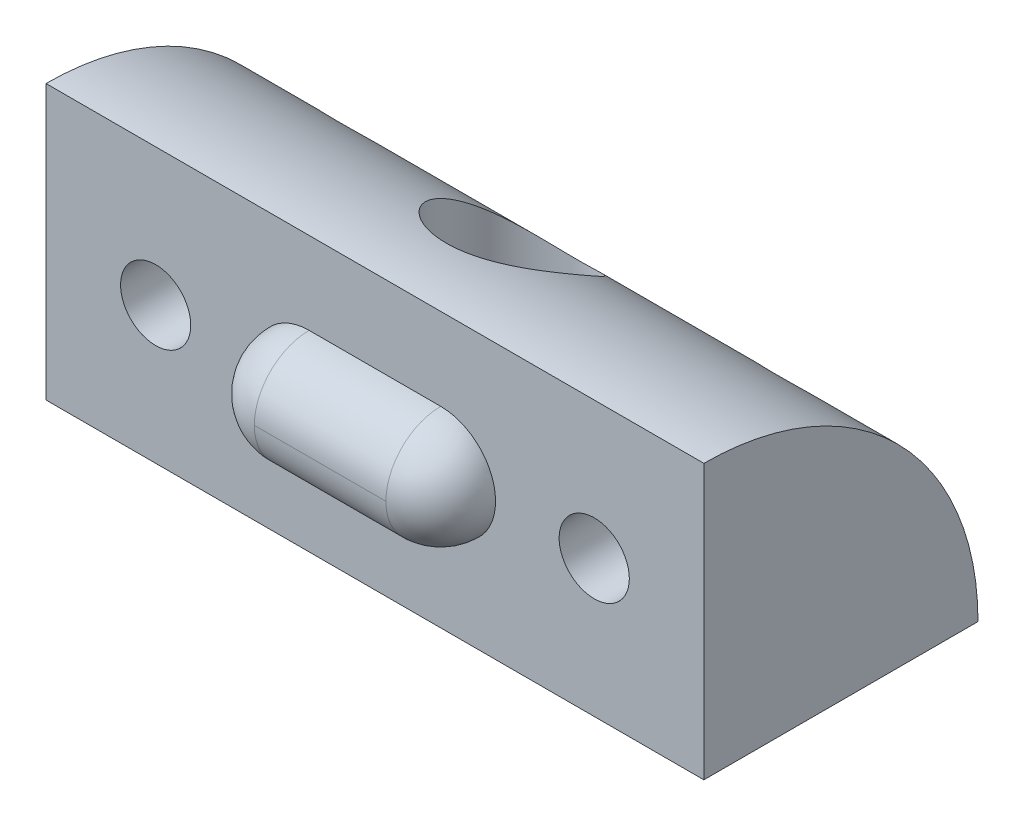
ISO-10303-21;
HEADER;
FILE_DESCRIPTION(('STEP AP214'),'2;1');
FILE_NAME('part.step','',(''),(''),'','','');
FILE_SCHEMA(('AUTOMOTIVE_DESIGN { 1 0 10303 214 1 1 1 1 }'));
ENDSEC;
DATA;
#1=APPLICATION_CONTEXT('core data for automotive mechanical design processes');
#2=APPLICATION_PROTOCOL_DEFINITION('international standard','automotive_design',2000,#1);
#3=PRODUCT_CONTEXT('',#1,'mechanical');
#4=PRODUCT('Part','Part','',(#3));
#5=PRODUCT_RELATED_PRODUCT_CATEGORY('part','',(#4));
#6=PRODUCT_DEFINITION_FORMATION('','',#4);
#7=PRODUCT_DEFINITION_CONTEXT('part definition',#1,'design');
#8=PRODUCT_DEFINITION('design','',#6,#7);
#9=PRODUCT_DEFINITION_SHAPE('','',#8);
#10=(LENGTH_UNIT() NAMED_UNIT(*) SI_UNIT(.MILLI.,.METRE.));
#11=(NAMED_UNIT(*) PLANE_ANGLE_UNIT() SI_UNIT($,.RADIAN.));
#12=(NAMED_UNIT(*) SI_UNIT($,.STERADIAN.) SOLID_ANGLE_UNIT());
#13=UNCERTAINTY_MEASURE_WITH_UNIT(LENGTH_MEASURE(1.E-05),#10,'distance_accuracy_value','');
#14=(GEOMETRIC_REPRESENTATION_CONTEXT(3) GLOBAL_UNCERTAINTY_ASSIGNED_CONTEXT((#13)) GLOBAL_UNIT_ASSIGNED_CONTEXT((#10,
#11,#12)) REPRESENTATION_CONTEXT('',''));
#15=CARTESIAN_POINT('',(0.,0.,0.));
#16=DIRECTION('',(0.,0.,1.));
#17=DIRECTION('',(1.,0.,0.));
#18=AXIS2_PLACEMENT_3D('',#15,#16,#17);
#19=CARTESIAN_POINT('',(70.,0.,0.));
#20=DIRECTION('',(0.,0.,-1.));
#21=DIRECTION('',(-1.,0.,0.));
#22=AXIS2_PLACEMENT_3D('',#19,#20,#21);
#23=PLANE('',#22);
#24=DIRECTION('',(0.,1.,0.));
#25=VECTOR('',#24,1.);
#26=CARTESIAN_POINT('',(40.,0.,0.));
#27=LINE('',#26,#25);
#28=CARTESIAN_POINT('',(40.,0.,0.));
#29=VERTEX_POINT('',#28);
#30=CARTESIAN_POINT('',(40.,12.5,0.));
#31=VERTEX_POINT('',#30);
#32=EDGE_CURVE('E106',#29,#31,#27,.T.);
#33=ORIENTED_EDGE('',*,*,#32,.F.);
#34=DIRECTION('',(-1.,0.,0.));
#35=VECTOR('',#34,1.);
#36=CARTESIAN_POINT('',(70.,0.,0.));
#37=LINE('',#36,#35);
#38=CARTESIAN_POINT('',(70.,0.,0.));
#39=VERTEX_POINT('',#38);
#40=EDGE_CURVE('E179',#39,#29,#37,.T.);
#41=ORIENTED_EDGE('',*,*,#40,.F.);
#42=DIRECTION('',(0.,-1.,0.));
#43=VECTOR('',#42,1.);
#44=CARTESIAN_POINT('',(70.,0.,0.));
#45=LINE('',#44,#43);
#46=CARTESIAN_POINT('',(70.,12.5,0.));
#47=VERTEX_POINT('',#46);
#48=EDGE_CURVE('E182',#47,#39,#45,.T.);
#49=ORIENTED_EDGE('',*,*,#48,.F.);
#50=DIRECTION('',(-1.,0.,0.));
#51=VECTOR('',#50,1.);
#52=CARTESIAN_POINT('',(70.,12.5,0.));
#53=LINE('',#52,#51);
#54=EDGE_CURVE('E45',#47,#31,#53,.T.);
#55=ORIENTED_EDGE('',*,*,#54,.T.);
#56=EDGE_LOOP('',(#33,#41,#49,#55));
#57=FACE_BOUND('',#56,.T.);
#58=CARTESIAN_POINT('',(45.,6.25,0.));
#59=DIRECTION('',(0.,0.,1.));
#60=DIRECTION('',(1.,0.,0.));
#61=AXIS2_PLACEMENT_3D('',#58,#59,#60);
#62=CIRCLE('',#61,1.6);
#63=CARTESIAN_POINT('',(46.6,6.25,0.));
#64=VERTEX_POINT('',#63);
#65=EDGE_CURVE('E189',#64,#64,#62,.T.);
#66=ORIENTED_EDGE('',*,*,#65,.F.);
#67=EDGE_LOOP('',(#66));
#68=FACE_BOUND('',#67,.T.);
#69=CARTESIAN_POINT('',(65.,6.25,0.));
#70=DIRECTION('',(0.,0.,1.));
#71=DIRECTION('',(1.,0.,0.));
#72=AXIS2_PLACEMENT_3D('',#69,#70,#71);
#73=CIRCLE('',#72,1.60000000000001);
#74=CARTESIAN_POINT('',(66.6,6.25,0.));
#75=VERTEX_POINT('',#74);
#76=EDGE_CURVE('E190',#75,#75,#73,.T.);
#77=ORIENTED_EDGE('',*,*,#76,.F.);
#78=EDGE_LOOP('',(#77));
#79=FACE_BOUND('',#78,.T.);
#80=CARTESIAN_POINT('',(58.,6.25,0.));
#81=DIRECTION('',(0.,0.,1.));
#82=DIRECTION('',(1.,0.,0.));
#83=AXIS2_PLACEMENT_3D('',#80,#81,#82);
#84=CIRCLE('',#83,2.5);
#85=CARTESIAN_POINT('',(58.,3.75,0.));
#86=VERTEX_POINT('',#85);
#87=CARTESIAN_POINT('',(58.,8.75,0.));
#88=VERTEX_POINT('',#87);
#89=EDGE_CURVE('E74',#86,#88,#84,.T.);
#90=ORIENTED_EDGE('',*,*,#89,.F.);
#91=DIRECTION('',(1.,0.,0.));
#92=VECTOR('',#91,1.);
#93=CARTESIAN_POINT('',(58.,3.75,0.));
#94=LINE('',#93,#92);
#95=CARTESIAN_POINT('',(52.,3.75,0.));
#96=VERTEX_POINT('',#95);
#97=EDGE_CURVE('E100',#96,#86,#94,.T.);
#98=ORIENTED_EDGE('',*,*,#97,.F.);
#99=CARTESIAN_POINT('',(52.,6.25,0.));
#100=DIRECTION('',(0.,0.,1.));
#101=DIRECTION('',(1.,0.,0.));
#102=AXIS2_PLACEMENT_3D('',#99,#100,#101);
#103=CIRCLE('',#102,2.5);
#104=CARTESIAN_POINT('',(52.,8.75,0.));
#105=VERTEX_POINT('',#104);
#106=EDGE_CURVE('E104',#105,#96,#103,.T.);
#107=ORIENTED_EDGE('',*,*,#106,.F.);
#108=DIRECTION('',(-1.,0.,0.));
#109=VECTOR('',#108,1.);
#110=CARTESIAN_POINT('',(58.,8.75,0.));
#111=LINE('',#110,#109);
#112=EDGE_CURVE('E54',#88,#105,#111,.T.);
#113=ORIENTED_EDGE('',*,*,#112,.F.);
#114=EDGE_LOOP('',(#90,#98,#107,#113));
#115=FACE_BOUND('',#114,.T.);
#116=ADVANCED_FACE('F35',(#57,#68,#79,#115),#23,.F.);
#117=CARTESIAN_POINT('',(70.,0.,0.));
#118=DIRECTION('',(0.,1.,0.));
#119=DIRECTION('',(0.,0.,1.));
#120=AXIS2_PLACEMENT_3D('',#117,#118,#119);
#121=PLANE('',#120);
#122=CARTESIAN_POINT('',(55.,0.,-6.25));
#123=DIRECTION('',(0.,-1.,0.));
#124=DIRECTION('',(0.,0.,-1.));
#125=AXIS2_PLACEMENT_3D('',#122,#123,#124);
#126=CIRCLE('',#125,3.);
#127=CARTESIAN_POINT('',(55.,0.,-9.25));
#128=VERTEX_POINT('',#127);
#129=EDGE_CURVE('E115',#128,#128,#126,.T.);
#130=ORIENTED_EDGE('',*,*,#129,.F.);
#131=EDGE_LOOP('',(#130));
#132=FACE_BOUND('',#131,.T.);
#133=DIRECTION('',(0.,0.,1.));
#134=VECTOR('',#133,1.);
#135=CARTESIAN_POINT('',(40.,0.,0.));
#136=LINE('',#135,#134);
#137=CARTESIAN_POINT('',(40.,0.,-12.5));
#138=VERTEX_POINT('',#137);
#139=EDGE_CURVE('E108',#138,#29,#136,.T.);
#140=ORIENTED_EDGE('',*,*,#139,.F.);
#141=DIRECTION('',(-1.,0.,0.));
#142=VECTOR('',#141,1.);
#143=CARTESIAN_POINT('',(70.,0.,-12.5));
#144=LINE('',#143,#142);
#145=CARTESIAN_POINT('',(70.,0.,-12.5));
#146=VERTEX_POINT('',#145);
#147=EDGE_CURVE('E11',#146,#138,#144,.T.);
#148=ORIENTED_EDGE('',*,*,#147,.F.);
#149=DIRECTION('',(0.,0.,-1.));
#150=VECTOR('',#149,1.);
#151=CARTESIAN_POINT('',(70.,0.,0.));
#152=LINE('',#151,#150);
#153=EDGE_CURVE('E186',#39,#146,#152,.T.);
#154=ORIENTED_EDGE('',*,*,#153,.F.);
#155=ORIENTED_EDGE('',*,*,#40,.T.);
#156=EDGE_LOOP('',(#140,#148,#154,#155));
#157=FACE_BOUND('',#156,.T.);
#158=ADVANCED_FACE('F146',(#132,#157),#121,.F.);
#159=CARTESIAN_POINT('',(70.,0.,0.));
#160=DIRECTION('',(-1.,0.,0.));
#161=DIRECTION('',(0.,0.,1.));
#162=AXIS2_PLACEMENT_3D('',#159,#160,#161);
#163=CYLINDRICAL_SURFACE('',#162,12.5);
#164=CARTESIAN_POINT('',(68.,6.25,-10.8253175473055));
#165=CARTESIAN_POINT('',(67.9999973266204,6.08166476944066,-10.9225007656544));
#166=CARTESIAN_POINT('',(67.9858168927422,5.91085991304591,-11.0158425192816));
#167=CARTESIAN_POINT('',(67.9268116727942,5.56893258641195,-11.1925875034078));
#168=CARTESIAN_POINT('',(67.881947018588,5.39780999216046,-11.275977637969));
#169=CARTESIAN_POINT('',(67.7906657534425,5.14533384977919,-11.3922906288415));
#170=CARTESIAN_POINT('',(67.7560999906545,5.06162964623966,-11.4296993282792));
#171=CARTESIAN_POINT('',(67.6789274548428,4.89662357664193,-11.5013536954113));
#172=CARTESIAN_POINT('',(67.6363242262492,4.81532066984877,-11.5356007474785));
#173=CARTESIAN_POINT('',(67.5431947029471,4.65605197120116,-11.6008013146132));
#174=CARTESIAN_POINT('',(67.4926718876983,4.57808473288429,-11.631756266083));
#175=CARTESIAN_POINT('',(67.3839283600971,4.42637953936193,-11.6903281855886));
#176=CARTESIAN_POINT('',(67.3257084975279,4.35264111856559,-11.7179455214666));
#177=CARTESIAN_POINT('',(67.2079134943238,4.21717392841966,-11.7673333214823));
#178=CARTESIAN_POINT('',(67.1490093176383,4.15497255080365,-11.7894107472818));
#179=CARTESIAN_POINT('',(67.0255687947048,4.03539897506827,-11.8308732109975));
#180=CARTESIAN_POINT('',(66.9610304639027,3.97802849265868,-11.8502572939389));
#181=CARTESIAN_POINT('',(66.8268251272258,3.86878442444124,-11.8863710900934));
#182=CARTESIAN_POINT('',(66.7571612195077,3.81690756352832,-11.9031023877966));
#183=CARTESIAN_POINT('',(66.6131988031283,3.71915515562737,-11.9340064698822));
#184=CARTESIAN_POINT('',(66.5388986485812,3.67328175799915,-11.9481783386242));
#185=CARTESIAN_POINT('',(66.3191422967688,3.55059940795259,-11.9854195102371));
#186=CARTESIAN_POINT('',(66.168457348775,3.48196655043035,-12.005384128521));
#187=CARTESIAN_POINT('',(65.8571803312922,3.37030895397797,-12.037209750765));
#188=CARTESIAN_POINT('',(65.6965896190894,3.32728071527113,-12.049071862252));
#189=CARTESIAN_POINT('',(65.3728592706779,3.26879794782722,-12.0650681051611));
#190=CARTESIAN_POINT('',(65.209807141428,3.25289443382583,-12.0693281271344));
#191=CARTESIAN_POINT('',(64.8832637909658,3.24782745948786,-12.0706928940414));
#192=CARTESIAN_POINT('',(64.7197725807565,3.25866333522313,-12.0677978166333));
#193=CARTESIAN_POINT('',(64.3974017447757,3.30664046417044,-12.0547390748307));
#194=CARTESIAN_POINT('',(64.2385119020278,3.34371789545777,-12.0445930448499));
#195=CARTESIAN_POINT('',(63.9294357800333,3.4428256809326,-12.0166377285413));
#196=CARTESIAN_POINT('',(63.7792491866696,3.50485513391074,-11.9988287189811));
#197=CARTESIAN_POINT('',(63.4915603256694,3.65178269143177,-11.9549295448695));
#198=CARTESIAN_POINT('',(63.3540766342677,3.7367135971344,-11.9288274927732));
#199=CARTESIAN_POINT('',(63.0957322253052,3.92633045242945,-11.8677637747331));
#200=CARTESIAN_POINT('',(62.974871102794,4.03101592062407,-11.8328023246762));
#201=CARTESIAN_POINT('',(62.7514039412975,4.25765669875745,-11.7531661147979));
#202=CARTESIAN_POINT('',(62.6490237740029,4.37979673496618,-11.7083842949025));
#203=CARTESIAN_POINT('',(62.4662483794489,4.63603422895777,-11.609308388074));
#204=CARTESIAN_POINT('',(62.385855746113,4.77013309508083,-11.5550131800615));
#205=CARTESIAN_POINT('',(62.2450622842901,5.05162107648432,-11.4348363589837));
#206=CARTESIAN_POINT('',(62.1856412413285,5.19933170379415,-11.3685643360296));
#207=CARTESIAN_POINT('',(62.0914867810008,5.49824316442016,-11.2270523177831));
#208=CARTESIAN_POINT('',(62.0567625178204,5.64944527048075,-11.1518090092195));
#209=CARTESIAN_POINT('',(62.0088651896586,5.96544000405546,-10.9862732546593));
#210=CARTESIAN_POINT('',(61.9980011348576,6.13018650712781,-10.8952318539103));
#211=CARTESIAN_POINT('',(62.0026043541375,6.45505160150145,-10.7059667655623));
#212=CARTESIAN_POINT('',(62.0180808462999,6.61516855271068,-10.6077405751033));
#213=CARTESIAN_POINT('',(62.0770951709249,6.94951046649875,-10.3922627946695));
#214=CARTESIAN_POINT('',(62.124225910264,7.12261380260256,-10.2742615189599));
#215=CARTESIAN_POINT('',(62.2473674279646,7.45609699092058,-10.0348790749703));
#216=CARTESIAN_POINT('',(62.3234183554811,7.6164587785014,-9.91349342633819));
#217=CARTESIAN_POINT('',(62.4635696467191,7.85514694388913,-9.72413619066091));
#218=CARTESIAN_POINT('',(62.5184688679155,7.93880482636895,-9.65590725647512));
#219=CARTESIAN_POINT('',(62.6368105594293,8.10078308376453,-9.52042241485925));
#220=CARTESIAN_POINT('',(62.7002551559596,8.1791021229711,-9.4531667542207));
#221=CARTESIAN_POINT('',(62.8355620395315,8.3297720201676,-9.32067341060217));
#222=CARTESIAN_POINT('',(62.9074154066027,8.40212906617064,-9.25543368038264));
#223=CARTESIAN_POINT('',(63.059611714218,8.54029479483283,-9.12809899734072));
#224=CARTESIAN_POINT('',(63.1399500868163,8.60610696427867,-9.06600237877656));
#225=CARTESIAN_POINT('',(63.33470786413,8.74909253749897,-8.92837734866243));
#226=CARTESIAN_POINT('',(63.4521227842016,8.82375452227944,-8.85440529442961));
#227=CARTESIAN_POINT('',(63.701493243671,8.95811053686501,-8.7184509054412));
#228=CARTESIAN_POINT('',(63.8334215126426,9.01783197088064,-8.65644666757568));
#229=CARTESIAN_POINT('',(64.0826981089934,9.10874245966485,-8.56062351542304));
#230=CARTESIAN_POINT('',(64.1975938424691,9.14325982541012,-8.52364001933629));
#231=CARTESIAN_POINT('',(64.4341878646062,9.19865585196656,-8.46382975339931));
#232=CARTESIAN_POINT('',(64.55587939688,9.21954780604178,-8.44098918648693));
#233=CARTESIAN_POINT('',(64.8036912281418,9.24617516166478,-8.41181697827873));
#234=CARTESIAN_POINT('',(64.9298339062167,9.2518178966057,-8.40558627505534));
#235=CARTESIAN_POINT('',(65.1814607388624,9.24714980642375,-8.41072110563979));
#236=CARTESIAN_POINT('',(65.3069448653725,9.23683830694501,-8.42208738323935));
#237=CARTESIAN_POINT('',(65.5419649790369,9.20281405155784,-8.45924058898394));
#238=CARTESIAN_POINT('',(65.6519201599882,9.18039028173262,-8.48363829340057));
#239=CARTESIAN_POINT('',(65.8657211266792,9.12450118528426,-8.54372052651832));
#240=CARTESIAN_POINT('',(65.9695637740596,9.09103024398218,-8.57941079423556));
#241=CARTESIAN_POINT('',(66.2182770621743,8.99609986041725,-8.67910584844492));
#242=CARTESIAN_POINT('',(66.3588167640645,8.92892471172138,-8.74846845351311));
#243=CARTESIAN_POINT('',(66.6228761374935,8.77775445304617,-8.90014376461336));
#244=CARTESIAN_POINT('',(66.7463518723194,8.69371724042968,-8.98248877368765));
#245=CARTESIAN_POINT('',(67.0166680601018,8.47986022113171,-9.18534270164034));
#246=CARTESIAN_POINT('',(67.1565308062729,8.34431719562657,-9.30911258014853));
#247=CARTESIAN_POINT('',(67.4058182245213,8.05247268365261,-9.5626992565583));
#248=CARTESIAN_POINT('',(67.5152052558842,7.89614587578619,-9.69252330310692));
#249=CARTESIAN_POINT('',(67.7041632568473,7.56327997146987,-9.95451628347097));
#250=CARTESIAN_POINT('',(67.7832279218419,7.38645693018936,-10.0866894327606));
#251=CARTESIAN_POINT('',(67.9064083218888,7.01828461757614,-10.3462110581482));
#252=CARTESIAN_POINT('',(67.9506324731979,6.82698245523553,-10.4735733174591));
#253=CARTESIAN_POINT('',(67.9837452979679,6.56818467307366,-10.6355276503307));
#254=CARTESIAN_POINT('',(67.9898058286325,6.50515556812303,-10.6741949915242));
#255=CARTESIAN_POINT('',(67.9979345615712,6.37820460532468,-10.7505344265753));
#256=CARTESIAN_POINT('',(68.0000010208865,6.31428236997697,-10.7882060788583));
#257=CARTESIAN_POINT('',(68.,6.25,-10.8253175473055));
#258=B_SPLINE_CURVE_WITH_KNOTS('',3,(#164,#165,#166,#167,#168,#169,#170,#171,#172,#173,#174,
#175,#176,#177,#178,#179,#180,#181,#182,#183,#184,#185,#186,#187,#188,#189,#190,#191,#192,#193,
#194,#195,#196,#197,#198,#199,#200,#201,#202,#203,#204,#205,#206,#207,#208,#209,#210,#211,#212,
#213,#214,#215,#216,#217,#218,#219,#220,#221,#222,#223,#224,#225,#226,#227,#228,#229,#230,#231,
#232,#233,#234,#235,#236,#237,#238,#239,#240,#241,#242,#243,#244,#245,#246,#247,#248,#249,#250,
#251,#252,#253,#254,#255,#256,#257),.UNSPECIFIED.,.T.,.F.,(4,2,2,2,2,2,2,2,2,2,2,2,2,2,2,2,2,2,
2,2,2,2,2,2,2,2,2,2,2,2,2,2,2,2,2,2,2,2,2,2,2,2,2,2,2,2,4),(0.,0.582881545067615,
1.16652187295148,1.4601239164711,1.75359678623576,2.04694107861974,2.34025301168256,
2.60530645932383,2.87045364806778,3.13544186473161,3.40052469443575,3.89821365029763,
4.39583456372763,4.88513560317994,5.37442449360887,5.86252745876598,6.35061279635429,
6.83940095372021,7.32817720137333,7.82257331504188,8.31702772870473,8.83221810890478,
9.34759935180196,9.91099233637912,10.4745825253067,11.1163078404089,11.7589273180628,
12.1219018395389,12.4849668417342,12.8476501396231,13.2101391708763,13.6813322925675,
14.1516547004217,14.5267955769292,14.9015699077082,15.2786166032688,15.6556792363283,
15.9988223001706,16.3421400342996,16.8508281380153,17.3608025471617,18.0495069710797,
18.7390582840781,19.4396681731441,20.1380892060083,20.3605777893967,20.5831634418966),.UNSPECIFIED.);
#259=CARTESIAN_POINT('',(68.,6.25,-10.8253175473055));
#260=VERTEX_POINT('',#259);
#261=EDGE_CURVE('E196',#260,#260,#258,.T.);
#262=ORIENTED_EDGE('',*,*,#261,.F.);
#263=EDGE_LOOP('',(#262));
#264=FACE_BOUND('',#263,.T.);
#265=CARTESIAN_POINT('',(48.,6.25,-10.8253175473055));
#266=CARTESIAN_POINT('',(47.9999973266204,6.08166476944066,-10.9225007656544));
#267=CARTESIAN_POINT('',(47.9858168927422,5.91085991304591,-11.0158425192816));
#268=CARTESIAN_POINT('',(47.9268116727942,5.56893258641195,-11.1925875034078));
#269=CARTESIAN_POINT('',(47.881947018588,5.39780999216045,-11.275977637969));
#270=CARTESIAN_POINT('',(47.7906657534425,5.14533384977918,-11.3922906288415));
#271=CARTESIAN_POINT('',(47.7560999906545,5.06162964623965,-11.4296993282792));
#272=CARTESIAN_POINT('',(47.6789274548428,4.89662357664192,-11.5013536954113));
#273=CARTESIAN_POINT('',(47.6363242262492,4.81532066984876,-11.5356007474785));
#274=CARTESIAN_POINT('',(47.5431947029471,4.65605197120115,-11.6008013146132));
#275=CARTESIAN_POINT('',(47.4926718876983,4.57808473288428,-11.631756266083));
#276=CARTESIAN_POINT('',(47.3839283600971,4.42637953936192,-11.6903281855886));
#277=CARTESIAN_POINT('',(47.3257084975279,4.35264111856559,-11.7179455214666));
#278=CARTESIAN_POINT('',(47.2079134943238,4.21717392841965,-11.7673333214823));
#279=CARTESIAN_POINT('',(47.1490093176383,4.15497255080364,-11.7894107472818));
#280=CARTESIAN_POINT('',(47.0255687947048,4.03539897506826,-11.8308732109975));
#281=CARTESIAN_POINT('',(46.9610304639027,3.97802849265867,-11.8502572939389));
#282=CARTESIAN_POINT('',(46.8268251272258,3.86878442444123,-11.8863710900934));
#283=CARTESIAN_POINT('',(46.7571612195077,3.81690756352832,-11.9031023877966));
#284=CARTESIAN_POINT('',(46.6131988031283,3.71915515562737,-11.9340064698822));
#285=CARTESIAN_POINT('',(46.5388986485812,3.67328175799914,-11.9481783386242));
#286=CARTESIAN_POINT('',(46.3191422967688,3.55059940795258,-11.9854195102371));
#287=CARTESIAN_POINT('',(46.168457348775,3.48196655043035,-12.005384128521));
#288=CARTESIAN_POINT('',(45.8571803312922,3.37030895397796,-12.037209750765));
#289=CARTESIAN_POINT('',(45.6965896190894,3.32728071527112,-12.049071862252));
#290=CARTESIAN_POINT('',(45.3728592706779,3.26879794782721,-12.0650681051611));
#291=CARTESIAN_POINT('',(45.209807141428,3.25289443382582,-12.0693281271344));
#292=CARTESIAN_POINT('',(44.8832637909658,3.24782745948786,-12.0706928940414));
#293=CARTESIAN_POINT('',(44.7197725807565,3.25866333522313,-12.0677978166333));
#294=CARTESIAN_POINT('',(44.3974017447757,3.30664046417043,-12.0547390748307));
#295=CARTESIAN_POINT('',(44.2385119020278,3.34371789545776,-12.0445930448499));
#296=CARTESIAN_POINT('',(43.9294357800333,3.4428256809326,-12.0166377285413));
#297=CARTESIAN_POINT('',(43.7792491866696,3.50485513391073,-11.9988287189811));
#298=CARTESIAN_POINT('',(43.4915603256694,3.65178269143177,-11.9549295448695));
#299=CARTESIAN_POINT('',(43.3540766342677,3.7367135971344,-11.9288274927732));
#300=CARTESIAN_POINT('',(43.0957322253053,3.92633045242945,-11.8677637747331));
#301=CARTESIAN_POINT('',(42.974871102794,4.03101592062407,-11.8328023246762));
#302=CARTESIAN_POINT('',(42.7514039412975,4.25765669875745,-11.7531661147979));
#303=CARTESIAN_POINT('',(42.6490237740029,4.37979673496617,-11.7083842949025));
#304=CARTESIAN_POINT('',(42.4662483794489,4.63603422895776,-11.609308388074));
#305=CARTESIAN_POINT('',(42.385855746113,4.77013309508082,-11.5550131800615));
#306=CARTESIAN_POINT('',(42.2450622842901,5.05162107648432,-11.4348363589837));
#307=CARTESIAN_POINT('',(42.1856412413285,5.19933170379414,-11.3685643360296));
#308=CARTESIAN_POINT('',(42.0914867810008,5.49824316442016,-11.2270523177831));
#309=CARTESIAN_POINT('',(42.0567625178204,5.64944527048075,-11.1518090092195));
#310=CARTESIAN_POINT('',(42.0088651896586,5.96544000405546,-10.9862732546593));
#311=CARTESIAN_POINT('',(41.9980011348576,6.13018650712781,-10.8952318539103));
#312=CARTESIAN_POINT('',(42.0026043541375,6.45505160150145,-10.7059667655623));
#313=CARTESIAN_POINT('',(42.0180808462999,6.61516855271068,-10.6077405751032));
#314=CARTESIAN_POINT('',(42.0770951709249,6.94951046649876,-10.3922627946695));
#315=CARTESIAN_POINT('',(42.124225910264,7.12261380260256,-10.2742615189599));
#316=CARTESIAN_POINT('',(42.2473674279646,7.45609699092059,-10.0348790749702));
#317=CARTESIAN_POINT('',(42.3234183554811,7.6164587785014,-9.91349342633819));
#318=CARTESIAN_POINT('',(42.4635696467191,7.85514694388914,-9.7241361906609));
#319=CARTESIAN_POINT('',(42.5184688679155,7.93880482636896,-9.65590725647511));
#320=CARTESIAN_POINT('',(42.6368105594293,8.10078308376453,-9.52042241485924));
#321=CARTESIAN_POINT('',(42.7002551559597,8.17910212297111,-9.45316675422069));
#322=CARTESIAN_POINT('',(42.8355620395315,8.3297720201676,-9.32067341060216));
#323=CARTESIAN_POINT('',(42.9074154066027,8.40212906617065,-9.25543368038264));
#324=CARTESIAN_POINT('',(43.059611714218,8.54029479483283,-9.12809899734071));
#325=CARTESIAN_POINT('',(43.1399500868163,8.60610696427868,-9.06600237877656));
#326=CARTESIAN_POINT('',(43.33470786413,8.74909253749898,-8.92837734866242));
#327=CARTESIAN_POINT('',(43.4521227842016,8.82375452227945,-8.8544052944296));
#328=CARTESIAN_POINT('',(43.701493243671,8.95811053686502,-8.71845090544119));
#329=CARTESIAN_POINT('',(43.8334215126426,9.01783197088065,-8.65644666757567));
#330=CARTESIAN_POINT('',(44.0826981089934,9.10874245966486,-8.56062351542302));
#331=CARTESIAN_POINT('',(44.1975938424691,9.14325982541014,-8.52364001933628));
#332=CARTESIAN_POINT('',(44.4341878646062,9.19865585196657,-8.4638297533993));
#333=CARTESIAN_POINT('',(44.55587939688,9.21954780604178,-8.44098918648693));
#334=CARTESIAN_POINT('',(44.8036912281418,9.24617516166479,-8.41181697827872));
#335=CARTESIAN_POINT('',(44.9298339062167,9.25181789660571,-8.40558627505533));
#336=CARTESIAN_POINT('',(45.1814607388624,9.24714980642375,-8.41072110563978));
#337=CARTESIAN_POINT('',(45.3069448653725,9.23683830694502,-8.42208738323934));
#338=CARTESIAN_POINT('',(45.5419649790369,9.20281405155785,-8.45924058898393));
#339=CARTESIAN_POINT('',(45.6519201599882,9.18039028173263,-8.48363829340056));
#340=CARTESIAN_POINT('',(45.8657211266792,9.12450118528427,-8.54372052651831));
#341=CARTESIAN_POINT('',(45.9695637740596,9.09103024398219,-8.57941079423555));
#342=CARTESIAN_POINT('',(46.2182770621743,8.99609986041727,-8.67910584844491));
#343=CARTESIAN_POINT('',(46.3588167640645,8.9289247117214,-8.7484684535131));
#344=CARTESIAN_POINT('',(46.6228761374935,8.77775445304619,-8.90014376461335));
#345=CARTESIAN_POINT('',(46.7463518723194,8.69371724042969,-8.98248877368763));
#346=CARTESIAN_POINT('',(47.0166680601018,8.47986022113172,-9.18534270164033));
#347=CARTESIAN_POINT('',(47.1565308062729,8.34431719562658,-9.30911258014851));
#348=CARTESIAN_POINT('',(47.4058182245213,8.05247268365263,-9.56269925655829));
#349=CARTESIAN_POINT('',(47.5152052558842,7.89614587578621,-9.69252330310691));
#350=CARTESIAN_POINT('',(47.7041632568473,7.5632799714699,-9.95451628347095));
#351=CARTESIAN_POINT('',(47.7832279218419,7.38645693018938,-10.0866894327606));
#352=CARTESIAN_POINT('',(47.9064083218888,7.01828461757616,-10.3462110581482));
#353=CARTESIAN_POINT('',(47.9506324731979,6.82698245523556,-10.4735733174591));
#354=CARTESIAN_POINT('',(47.9837452979679,6.56818467307368,-10.6355276503307));
#355=CARTESIAN_POINT('',(47.9898058286325,6.50515556812305,-10.6741949915242));
#356=CARTESIAN_POINT('',(47.9979345615713,6.3782046053247,-10.7505344265753));
#357=CARTESIAN_POINT('',(48.0000010208866,6.31428236997697,-10.7882060788583));
#358=CARTESIAN_POINT('',(48.,6.25,-10.8253175473055));
#359=B_SPLINE_CURVE_WITH_KNOTS('',3,(#265,#266,#267,#268,#269,#270,#271,#272,#273,#274,#275,
#276,#277,#278,#279,#280,#281,#282,#283,#284,#285,#286,#287,#288,#289,#290,#291,#292,#293,#294,
#295,#296,#297,#298,#299,#300,#301,#302,#303,#304,#305,#306,#307,#308,#309,#310,#311,#312,#313,
#314,#315,#316,#317,#318,#319,#320,#321,#322,#323,#324,#325,#326,#327,#328,#329,#330,#331,#332,
#333,#334,#335,#336,#337,#338,#339,#340,#341,#342,#343,#344,#345,#346,#347,#348,#349,#350,#351,
#352,#353,#354,#355,#356,#357,#358),.UNSPECIFIED.,.T.,.F.,(4,2,2,2,2,2,2,2,2,2,2,2,2,2,2,2,2,2,
2,2,2,2,2,2,2,2,2,2,2,2,2,2,2,2,2,2,2,2,2,2,2,2,2,2,2,2,4),(0.,0.582881545067616,
1.16652187295148,1.46012391647111,1.75359678623577,2.04694107861975,2.34025301168257,
2.60530645932384,2.87045364806778,3.13544186473161,3.40052469443575,3.89821365029764,
4.39583456372765,4.88513560317997,5.37442449360889,5.86252745876601,6.35061279635431,
6.83940095372023,7.32817720137335,7.8225733150419,8.31702772870475,8.8322181089048,
9.34759935180199,9.91099233637915,10.4745825253067,11.116307840409,11.7589273180629,
12.1219018395389,12.4849668417343,12.8476501396231,13.2101391708764,13.6813322925675,
14.1516547004217,14.5267955769293,14.9015699077082,15.2786166032689,15.6556792363283,
15.9988223001706,16.3421400342996,16.8508281380153,17.3608025471618,18.0495069710797,
18.7390582840781,19.4396681731441,20.1380892060083,20.3605777893967,20.5831634418967),.UNSPECIFIED.);
#360=CARTESIAN_POINT('',(48.,6.25,-10.8253175473055));
#361=VERTEX_POINT('',#360);
#362=EDGE_CURVE('E193',#361,#361,#359,.T.);
#363=ORIENTED_EDGE('',*,*,#362,.F.);
#364=EDGE_LOOP('',(#363));
#365=FACE_BOUND('',#364,.T.);
#366=CARTESIAN_POINT('',(55.,8.40758586040012,-9.25));
#367=CARTESIAN_POINT('',(54.9331173188424,8.40758657777007,-9.24999950862273));
#368=CARTESIAN_POINT('',(54.8662140535514,8.41005520329806,-9.24775738810401));
#369=CARTESIAN_POINT('',(54.7330284578139,8.41984609104945,-9.23884377134487));
#370=CARTESIAN_POINT('',(54.6667466132092,8.42717187422553,-9.23216906191591));
#371=CARTESIAN_POINT('',(54.5352811427725,8.44645431859598,-9.21453088959206));
#372=CARTESIAN_POINT('',(54.4701004227902,8.45842168800823,-9.20355750899981));
#373=CARTESIAN_POINT('',(54.341475687246,8.48661266872388,-9.17756897041478));
#374=CARTESIAN_POINT('',(54.2780326384919,8.50283859833912,-9.16255161080943));
#375=CARTESIAN_POINT('',(54.0923086056869,8.55684286807243,-9.11223572315634));
#376=CARTESIAN_POINT('',(53.9730729215054,8.60019419825492,-9.07145306659362));
#377=CARTESIAN_POINT('',(53.7447454514196,8.69815250509756,-8.9775691044579));
#378=CARTESIAN_POINT('',(53.6356566265102,8.75276275240589,-8.92446421878726));
#379=CARTESIAN_POINT('',(53.3740780014682,8.90046566375439,-8.77766224940497));
#380=CARTESIAN_POINT('',(53.228366035341,8.99884199669047,-8.67718531752827));
#381=CARTESIAN_POINT('',(52.9607113468756,9.20597257866288,-8.45712898685155));
#382=CARTESIAN_POINT('',(52.8388134633603,9.31474584131119,-8.33751430961098));
#383=CARTESIAN_POINT('',(52.6155494855423,9.54011993210581,-8.07875989638615));
#384=CARTESIAN_POINT('',(52.5148356549374,9.65685344731774,-7.9391758455988));
#385=CARTESIAN_POINT('',(52.3387422502019,9.89109663715344,-7.64535647238576));
#386=CARTESIAN_POINT('',(52.2633650899026,10.0086063846423,-7.49111975579104));
#387=CARTESIAN_POINT('',(52.1647464004684,10.1935125943656,-7.23575366762313));
#388=CARTESIAN_POINT('',(52.1327737874301,10.2618300902958,-7.13857419507847));
#389=CARTESIAN_POINT('',(52.0787269857638,10.3968591387808,-6.94043711085436));
#390=CARTESIAN_POINT('',(52.0566493309481,10.4635712459391,-6.83948083563079));
#391=CARTESIAN_POINT('',(52.0229238518715,10.5947553305993,-6.63445258415822));
#392=CARTESIAN_POINT('',(52.011272423242,10.6592280748394,-6.53038169750493));
#393=CARTESIAN_POINT('',(51.9989637703422,10.7853301247084,-6.31994606540553));
#394=CARTESIAN_POINT('',(51.9983032844601,10.8469602684776,-6.21358200984965));
#395=CARTESIAN_POINT('',(52.0114854871536,11.0009839219056,-5.9384595871409));
#396=CARTESIAN_POINT('',(52.0337942215884,11.0909286078104,-5.76863500531754));
#397=CARTESIAN_POINT('',(52.1089335716872,11.2603654296945,-5.43045669613042));
#398=CARTESIAN_POINT('',(52.1617440500058,11.3398644194896,-5.26210207266445));
#399=CARTESIAN_POINT('',(52.2645405441731,11.4502611701337,-5.01495967971303));
#400=CARTESIAN_POINT('',(52.3029015613807,11.4856865134571,-4.9332173908558));
#401=CARTESIAN_POINT('',(52.387463296219,11.5533719335426,-4.77254305853179));
#402=CARTESIAN_POINT('',(52.4336605073192,11.5856334159195,-4.69360977712332));
#403=CARTESIAN_POINT('',(52.5337468113385,11.6469068036515,-4.5394327845861));
#404=CARTESIAN_POINT('',(52.5876360851415,11.6759186325602,-4.46418916027798));
#405=CARTESIAN_POINT('',(52.7027728834256,11.7306523748729,-4.31831809409327));
#406=CARTESIAN_POINT('',(52.7640196573136,11.7563746233195,-4.24769018246681));
#407=CARTESIAN_POINT('',(52.9455327970456,11.8239044178516,-4.05735335807567));
#408=CARTESIAN_POINT('',(53.0737279476081,11.8620608155898,-3.9437272471401));
#409=CARTESIAN_POINT('',(53.3492513129213,11.9281429986125,-3.73912394790553));
#410=CARTESIAN_POINT('',(53.4965731894254,11.9560721613534,-3.64813928564918));
#411=CARTESIAN_POINT('',(53.7976937404313,12.0012457960729,-3.49657436045416));
#412=CARTESIAN_POINT('',(53.9507399371826,12.0189764850076,-3.43464259131001));
#413=CARTESIAN_POINT('',(54.2655610039122,12.0465587400524,-3.33662127688877));
#414=CARTESIAN_POINT('',(54.4273349531251,12.0564111355827,-3.30052901129166));
#415=CARTESIAN_POINT('',(54.7526559725324,12.0685749314649,-3.25576927787141));
#416=CARTESIAN_POINT('',(54.916149039891,12.070987027792,-3.24673565116546));
#417=CARTESIAN_POINT('',(55.2423781511956,12.0686642908413,-3.25535895363249));
#418=CARTESIAN_POINT('',(55.4051142112936,12.0639296107612,-3.27301531068149));
#419=CARTESIAN_POINT('',(55.724916084995,12.0471176113857,-3.33435950098486));
#420=CARTESIAN_POINT('',(55.8819912310579,12.0350530234162,-3.37800219592078));
#421=CARTESIAN_POINT('',(56.1863238622808,12.0031209063732,-3.48976266384696));
#422=CARTESIAN_POINT('',(56.3335817418877,11.9832536910219,-3.55787945279136));
#423=CARTESIAN_POINT('',(56.6144929845796,11.9350621593373,-3.71633299808818));
#424=CARTESIAN_POINT('',(56.7481177465895,11.9067205346414,-3.80671516265852));
#425=CARTESIAN_POINT('',(56.99789138766,11.8410395386871,-4.00634387694044));
#426=CARTESIAN_POINT('',(57.1140404996752,11.8037002873865,-4.11559017514683));
#427=CARTESIAN_POINT('',(57.3276713583885,11.7191129422445,-4.35065218764821));
#428=CARTESIAN_POINT('',(57.4248681976048,11.6717331200735,-4.47667895381936));
#429=CARTESIAN_POINT('',(57.5968026896475,11.5674621227182,-4.73960036545752));
#430=CARTESIAN_POINT('',(57.6715370961332,11.5105695745724,-4.87649657820006));
#431=CARTESIAN_POINT('',(57.800928502268,11.3848621238753,-5.16338675903059));
#432=CARTESIAN_POINT('',(57.8544598632382,11.3156084728783,-5.31369400773462));
#433=CARTESIAN_POINT('',(57.9366073533791,11.1682887463454,-5.61673900605399));
#434=CARTESIAN_POINT('',(57.965213463964,11.0902191415075,-5.76947770788628));
#435=CARTESIAN_POINT('',(58.0003870830883,10.9184663879086,-6.08877064130115));
#436=CARTESIAN_POINT('',(58.0044595926527,10.8240025834835,-6.25517597375072));
#437=CARTESIAN_POINT('',(57.9860407618475,10.6282378814551,-6.58232296811537));
#438=CARTESIAN_POINT('',(57.9635406819804,10.5269347447876,-6.74306274876876));
#439=CARTESIAN_POINT('',(57.8892065576908,10.3050596088395,-7.07825092966654));
#440=CARTESIAN_POINT('',(57.8336669503384,10.1837915611234,-7.25141337047472));
#441=CARTESIAN_POINT('',(57.6932043681138,9.93866965097691,-7.58390107961657));
#442=CARTESIAN_POINT('',(57.608233129994,9.81481185720261,-7.74320307878446));
#443=CARTESIAN_POINT('',(57.4540471411024,9.6231416011448,-7.97853923202691));
#444=CARTESIAN_POINT('',(57.3943401206225,9.554639228768,-8.06037986529878));
#445=CARTESIAN_POINT('',(57.2662418520527,9.41908456336951,-8.21837332554309));
#446=CARTESIAN_POINT('',(57.1978481004593,9.35203269492663,-8.29452450273378));
#447=CARTESIAN_POINT('',(57.052506844534,9.22060060384599,-8.4403878774094));
#448=CARTESIAN_POINT('',(56.9755743040548,9.15621597072037,-8.51011095913108));
#449=CARTESIAN_POINT('',(56.8130156347317,9.03138100263704,-8.64247824301362));
#450=CARTESIAN_POINT('',(56.7273955156307,8.9709279947942,-8.70512727620178));
#451=CARTESIAN_POINT('',(56.527901004813,8.84316209927565,-8.8350693555229));
#452=CARTESIAN_POINT('',(56.4119100980048,8.77716958985968,-8.90046396663218));
#453=CARTESIAN_POINT('',(56.1671183560861,8.65743647162248,-9.01697199732486));
#454=CARTESIAN_POINT('',(56.0383363706415,8.60367820748998,-9.06810602079929));
#455=CARTESIAN_POINT('',(55.7934688512335,8.52131022019268,-9.14548465920129));
#456=CARTESIAN_POINT('',(55.6792178938436,8.48992477003642,-9.17454231150943));
#457=CARTESIAN_POINT('',(55.4452885195081,8.44148000338155,-9.21913954384455));
#458=CARTESIAN_POINT('',(55.3256261732972,8.42438087080329,-9.23471669849651));
#459=CARTESIAN_POINT('',(55.1709707154152,8.41273103098189,-9.24532091640846));
#460=CARTESIAN_POINT('',(55.1368363416194,8.41080470580763,-9.2470733295291));
#461=CARTESIAN_POINT('',(55.0684697864798,8.40823183363831,-9.24941309110361));
#462=CARTESIAN_POINT('',(55.0342375902441,8.40758549317473,-9.25000025153857));
#463=CARTESIAN_POINT('',(55.,8.40758586040012,-9.25));
#464=B_SPLINE_CURVE_WITH_KNOTS('',3,(#366,#367,#368,#369,#370,#371,#372,#373,#374,#375,#376,
#377,#378,#379,#380,#381,#382,#383,#384,#385,#386,#387,#388,#389,#390,#391,#392,#393,#394,#395,
#396,#397,#398,#399,#400,#401,#402,#403,#404,#405,#406,#407,#408,#409,#410,#411,#412,#413,#414,
#415,#416,#417,#418,#419,#420,#421,#422,#423,#424,#425,#426,#427,#428,#429,#430,#431,#432,#433,
#434,#435,#436,#437,#438,#439,#440,#441,#442,#443,#444,#445,#446,#447,#448,#449,#450,#451,#452,
#453,#454,#455,#456,#457,#458,#459,#460,#461,#462,#463),.UNSPECIFIED.,.T.,.F.,(4,2,2,2,2,2,2,2,
2,2,2,2,2,2,2,2,2,2,2,2,2,2,2,2,2,2,2,2,2,2,2,2,2,2,2,2,2,2,2,2,2,2,2,2,2,2,2,2,4),(0.,
0.200601685640526,0.401348946625933,0.602562116426045,0.803885052421622,1.20181308296193,
1.59985687250723,2.20402094029606,2.80931183282107,3.43114712486947,4.05304164255409,
4.42169268305936,4.79021448457725,5.15860883804665,5.52689386687943,6.10473066345153,
6.68218640574937,6.97283164204132,7.26334716220761,7.55386951516227,7.84436225491056,
8.36790981975775,8.89128433126532,9.38702958585236,9.88272264190816,10.3716769481645,
10.8606207733912,11.3487177697302,11.8367951430308,12.3258762682261,12.8149508732733,
13.3108903499976,13.8069014670119,14.3265340927525,14.8463754861351,15.418296087285,
15.9904048406244,16.6435992673299,17.2978699414257,17.6643707078668,18.0309773400087,
18.3969513623721,18.7626739215807,19.2070423511699,19.6507653852187,20.0153157424179,
20.3788466733396,20.4815191479278,20.5842081878461),.UNSPECIFIED.);
#465=CARTESIAN_POINT('',(55.,8.40758586040012,-9.25));
#466=VERTEX_POINT('',#465);
#467=EDGE_CURVE('E118',#466,#466,#464,.T.);
#468=ORIENTED_EDGE('',*,*,#467,.F.);
#469=EDGE_LOOP('',(#468));
#470=FACE_BOUND('',#469,.T.);
#471=CARTESIAN_POINT('',(40.,0.,0.));
#472=DIRECTION('',(-1.,0.,0.));
#473=DIRECTION('',(0.,0.,1.));
#474=AXIS2_PLACEMENT_3D('',#471,#472,#473);
#475=CIRCLE('',#474,12.5);
#476=EDGE_CURVE('E113',#31,#138,#475,.T.);
#477=ORIENTED_EDGE('',*,*,#476,.F.);
#478=ORIENTED_EDGE('',*,*,#54,.F.);
#479=CARTESIAN_POINT('',(70.,0.,0.));
#480=DIRECTION('',(1.,0.,0.));
#481=DIRECTION('',(0.,0.,-1.));
#482=AXIS2_PLACEMENT_3D('',#479,#480,#481);
#483=CIRCLE('',#482,12.5);
#484=EDGE_CURVE('E184',#146,#47,#483,.T.);
#485=ORIENTED_EDGE('',*,*,#484,.F.);
#486=ORIENTED_EDGE('',*,*,#147,.T.);
#487=EDGE_LOOP('',(#477,#478,#485,#486));
#488=FACE_BOUND('',#487,.T.);
#489=ADVANCED_FACE('F153',(#264,#365,#470,#488),#163,.T.);
#490=CARTESIAN_POINT('',(70.,0.,0.));
#491=DIRECTION('',(1.,0.,0.));
#492=DIRECTION('',(0.,0.,-1.));
#493=AXIS2_PLACEMENT_3D('',#490,#491,#492);
#494=PLANE('',#493);
#495=ORIENTED_EDGE('',*,*,#153,.T.);
#496=ORIENTED_EDGE('',*,*,#484,.T.);
#497=ORIENTED_EDGE('',*,*,#48,.T.);
#498=EDGE_LOOP('',(#495,#496,#497));
#499=FACE_BOUND('',#498,.T.);
#500=ADVANCED_FACE('F160',(#499),#494,.T.);
#501=CARTESIAN_POINT('',(65.,6.25,-12.501));
#502=DIRECTION('',(0.,0.,1.));
#503=DIRECTION('',(1.,0.,0.));
#504=AXIS2_PLACEMENT_3D('',#501,#502,#503);
#505=CYLINDRICAL_SURFACE('',#504,1.60000000000001);
#506=CARTESIAN_POINT('',(65.,6.25,-4.));
#507=DIRECTION('',(0.,0.,1.));
#508=DIRECTION('',(1.,0.,0.));
#509=AXIS2_PLACEMENT_3D('',#506,#507,#508);
#510=CIRCLE('',#509,1.60000000000001);
#511=CARTESIAN_POINT('',(66.6,6.25,-4.));
#512=VERTEX_POINT('',#511);
#513=EDGE_CURVE('E204',#512,#512,#510,.T.);
#514=ORIENTED_EDGE('',*,*,#513,.F.);
#515=EDGE_LOOP('',(#514));
#516=FACE_BOUND('',#515,.T.);
#517=ORIENTED_EDGE('',*,*,#76,.T.);
#518=EDGE_LOOP('',(#517));
#519=FACE_BOUND('',#518,.T.);
#520=ADVANCED_FACE('F262',(#516,#519),#505,.F.);
#521=CARTESIAN_POINT('',(45.,6.25,-12.501));
#522=DIRECTION('',(0.,0.,1.));
#523=DIRECTION('',(1.,0.,0.));
#524=AXIS2_PLACEMENT_3D('',#521,#522,#523);
#525=CYLINDRICAL_SURFACE('',#524,1.6);
#526=CARTESIAN_POINT('',(45.,6.25,-4.));
#527=DIRECTION('',(0.,0.,1.));
#528=DIRECTION('',(1.,0.,0.));
#529=AXIS2_PLACEMENT_3D('',#526,#527,#528);
#530=CIRCLE('',#529,1.6);
#531=CARTESIAN_POINT('',(46.6,6.25,-4.));
#532=VERTEX_POINT('',#531);
#533=EDGE_CURVE('E232',#532,#532,#530,.T.);
#534=ORIENTED_EDGE('',*,*,#533,.F.);
#535=EDGE_LOOP('',(#534));
#536=FACE_BOUND('',#535,.T.);
#537=ORIENTED_EDGE('',*,*,#65,.T.);
#538=EDGE_LOOP('',(#537));
#539=FACE_BOUND('',#538,.T.);
#540=ADVANCED_FACE('F239',(#536,#539),#525,.F.);
#541=CARTESIAN_POINT('',(45.,6.25,-12.501));
#542=DIRECTION('',(0.,0.,1.));
#543=DIRECTION('',(1.,0.,0.));
#544=AXIS2_PLACEMENT_3D('',#541,#542,#543);
#545=CYLINDRICAL_SURFACE('',#544,3.);
#546=CARTESIAN_POINT('',(45.,6.25,-4.));
#547=DIRECTION('',(0.,0.,1.));
#548=DIRECTION('',(1.,0.,0.));
#549=AXIS2_PLACEMENT_3D('',#546,#547,#548);
#550=CIRCLE('',#549,3.);
#551=CARTESIAN_POINT('',(48.,6.25,-4.));
#552=VERTEX_POINT('',#551);
#553=EDGE_CURVE('E127',#552,#552,#550,.T.);
#554=ORIENTED_EDGE('',*,*,#553,.T.);
#555=EDGE_LOOP('',(#554));
#556=FACE_BOUND('',#555,.T.);
#557=ORIENTED_EDGE('',*,*,#362,.T.);
#558=EDGE_LOOP('',(#557));
#559=FACE_BOUND('',#558,.T.);
#560=ADVANCED_FACE('F212',(#556,#559),#545,.F.);
#561=CARTESIAN_POINT('',(45.,6.25,-4.));
#562=DIRECTION('',(0.,0.,1.));
#563=DIRECTION('',(1.,0.,0.));
#564=AXIS2_PLACEMENT_3D('',#561,#562,#563);
#565=PLANE('',#564);
#566=ORIENTED_EDGE('',*,*,#533,.T.);
#567=EDGE_LOOP('',(#566));
#568=FACE_BOUND('',#567,.T.);
#569=ORIENTED_EDGE('',*,*,#553,.F.);
#570=EDGE_LOOP('',(#569));
#571=FACE_BOUND('',#570,.T.);
#572=ADVANCED_FACE('F220',(#568,#571),#565,.F.);
#573=CARTESIAN_POINT('',(65.,6.25,-12.501));
#574=DIRECTION('',(0.,0.,1.));
#575=DIRECTION('',(1.,0.,0.));
#576=AXIS2_PLACEMENT_3D('',#573,#574,#575);
#577=CYLINDRICAL_SURFACE('',#576,2.99999999999999);
#578=CARTESIAN_POINT('',(65.,6.25,-4.));
#579=DIRECTION('',(0.,0.,1.));
#580=DIRECTION('',(1.,0.,0.));
#581=AXIS2_PLACEMENT_3D('',#578,#579,#580);
#582=CIRCLE('',#581,2.99999999999999);
#583=CARTESIAN_POINT('',(68.,6.25,-4.));
#584=VERTEX_POINT('',#583);
#585=EDGE_CURVE('E126',#584,#584,#582,.T.);
#586=ORIENTED_EDGE('',*,*,#585,.T.);
#587=EDGE_LOOP('',(#586));
#588=FACE_BOUND('',#587,.T.);
#589=ORIENTED_EDGE('',*,*,#261,.T.);
#590=EDGE_LOOP('',(#589));
#591=FACE_BOUND('',#590,.T.);
#592=ADVANCED_FACE('F206',(#588,#591),#577,.F.);
#593=CARTESIAN_POINT('',(65.,6.25,-4.));
#594=DIRECTION('',(0.,0.,1.));
#595=DIRECTION('',(1.,0.,0.));
#596=AXIS2_PLACEMENT_3D('',#593,#594,#595);
#597=PLANE('',#596);
#598=ORIENTED_EDGE('',*,*,#513,.T.);
#599=EDGE_LOOP('',(#598));
#600=FACE_BOUND('',#599,.T.);
#601=ORIENTED_EDGE('',*,*,#585,.F.);
#602=EDGE_LOOP('',(#601));
#603=FACE_BOUND('',#602,.T.);
#604=ADVANCED_FACE('F143',(#600,#603),#597,.F.);
#605=CARTESIAN_POINT('',(55.,12.501,-6.25));
#606=DIRECTION('',(0.,-1.,0.));
#607=DIRECTION('',(0.,0.,-1.));
#608=AXIS2_PLACEMENT_3D('',#605,#606,#607);
#609=CYLINDRICAL_SURFACE('',#608,3.);
#610=ORIENTED_EDGE('',*,*,#129,.T.);
#611=EDGE_LOOP('',(#610));
#612=FACE_BOUND('',#611,.T.);
#613=ORIENTED_EDGE('',*,*,#467,.T.);
#614=EDGE_LOOP('',(#613));
#615=FACE_BOUND('',#614,.T.);
#616=ADVANCED_FACE('F129',(#612,#615),#609,.F.);
#617=CARTESIAN_POINT('',(40.,0.,0.));
#618=DIRECTION('',(-1.,0.,0.));
#619=DIRECTION('',(0.,0.,1.));
#620=AXIS2_PLACEMENT_3D('',#617,#618,#619);
#621=PLANE('',#620);
#622=ORIENTED_EDGE('',*,*,#476,.T.);
#623=ORIENTED_EDGE('',*,*,#139,.T.);
#624=ORIENTED_EDGE('',*,*,#32,.T.);
#625=EDGE_LOOP('',(#622,#623,#624));
#626=FACE_BOUND('',#625,.T.);
#627=ADVANCED_FACE('F134',(#626),#621,.T.);
#628=CARTESIAN_POINT('',(52.,6.25,0.));
#629=DIRECTION('',(0.,0.,1.));
#630=DIRECTION('',(1.,0.,0.));
#631=AXIS2_PLACEMENT_3D('',#628,#629,#630);
#632=SPHERICAL_SURFACE('',#631,2.5);
#633=CARTESIAN_POINT('',(52.,6.25,0.));
#634=DIRECTION('',(1.,0.,0.));
#635=DIRECTION('',(0.,1.,0.));
#636=AXIS2_PLACEMENT_3D('',#633,#634,#635);
#637=CIRCLE('',#636,2.5);
#638=CARTESIAN_POINT('',(52.,6.25,2.5));
#639=VERTEX_POINT('',#638);
#640=EDGE_CURVE('E39',#105,#639,#637,.T.);
#641=ORIENTED_EDGE('',*,*,#640,.F.);
#642=ORIENTED_EDGE('',*,*,#106,.T.);
#643=CARTESIAN_POINT('',(52.,6.25,0.));
#644=DIRECTION('',(1.,0.,0.));
#645=DIRECTION('',(0.,0.,-1.));
#646=AXIS2_PLACEMENT_3D('',#643,#644,#645);
#647=CIRCLE('',#646,2.5);
#648=EDGE_CURVE('E96',#639,#96,#647,.T.);
#649=ORIENTED_EDGE('',*,*,#648,.F.);
#650=EDGE_LOOP('',(#641,#642,#649));
#651=FACE_BOUND('',#650,.T.);
#652=ADVANCED_FACE('F37',(#651),#632,.T.);
#653=CARTESIAN_POINT('',(58.,6.25,0.));
#654=DIRECTION('',(1.,0.,0.));
#655=DIRECTION('',(0.,0.,-1.));
#656=AXIS2_PLACEMENT_3D('',#653,#654,#655);
#657=CYLINDRICAL_SURFACE('',#656,2.5);
#658=CARTESIAN_POINT('',(58.,6.25,0.));
#659=DIRECTION('',(1.,0.,0.));
#660=DIRECTION('',(0.,0.,-1.));
#661=AXIS2_PLACEMENT_3D('',#658,#659,#660);
#662=CIRCLE('',#661,2.5);
#663=CARTESIAN_POINT('',(58.,6.25,2.5));
#664=VERTEX_POINT('',#663);
#665=EDGE_CURVE('E64',#88,#664,#662,.T.);
#666=ORIENTED_EDGE('',*,*,#665,.F.);
#667=ORIENTED_EDGE('',*,*,#112,.T.);
#668=ORIENTED_EDGE('',*,*,#640,.T.);
#669=DIRECTION('',(-1.,0.,0.));
#670=VECTOR('',#669,1.);
#671=CARTESIAN_POINT('',(52.,6.25,2.5));
#672=LINE('',#671,#670);
#673=EDGE_CURVE('E101',#664,#639,#672,.T.);
#674=ORIENTED_EDGE('',*,*,#673,.F.);
#675=EDGE_LOOP('',(#666,#667,#668,#674));
#676=FACE_BOUND('',#675,.T.);
#677=ADVANCED_FACE('F142',(#676),#657,.T.);
#678=CARTESIAN_POINT('',(58.,6.25,0.));
#679=DIRECTION('',(0.,0.,1.));
#680=DIRECTION('',(1.,0.,0.));
#681=AXIS2_PLACEMENT_3D('',#678,#679,#680);
#682=SPHERICAL_SURFACE('',#681,2.5);
#683=ORIENTED_EDGE('',*,*,#89,.T.);
#684=ORIENTED_EDGE('',*,*,#665,.T.);
#685=CARTESIAN_POINT('',(58.,6.25,0.));
#686=DIRECTION('',(-1.,0.,0.));
#687=DIRECTION('',(0.,0.,1.));
#688=AXIS2_PLACEMENT_3D('',#685,#686,#687);
#689=CIRCLE('',#688,2.5);
#690=EDGE_CURVE('E172',#86,#664,#689,.T.);
#691=ORIENTED_EDGE('',*,*,#690,.F.);
#692=EDGE_LOOP('',(#683,#684,#691));
#693=FACE_BOUND('',#692,.T.);
#694=ADVANCED_FACE('F167',(#693),#682,.T.);
#695=CARTESIAN_POINT('',(58.,6.25,0.));
#696=DIRECTION('',(-1.,0.,0.));
#697=DIRECTION('',(0.,0.,1.));
#698=AXIS2_PLACEMENT_3D('',#695,#696,#697);
#699=CYLINDRICAL_SURFACE('',#698,2.5);
#700=ORIENTED_EDGE('',*,*,#648,.T.);
#701=ORIENTED_EDGE('',*,*,#97,.T.);
#702=ORIENTED_EDGE('',*,*,#690,.T.);
#703=ORIENTED_EDGE('',*,*,#673,.T.);
#704=EDGE_LOOP('',(#700,#701,#702,#703));
#705=FACE_BOUND('',#704,.T.);
#706=ADVANCED_FACE('F98',(#705),#699,.T.);
#707=CLOSED_SHELL('',(#116,#158,#489,#500,#520,#540,#560,#572,#592,#604,#616,#627,#652,#677,
#694,#706));
#708=MANIFOLD_SOLID_BREP('B2',#707);
#709=ADVANCED_BREP_SHAPE_REPRESENTATION('',(#18,#708),#14);
#710=SHAPE_DEFINITION_REPRESENTATION(#9,#709);
ENDSEC;
END-ISO-10303-21;
